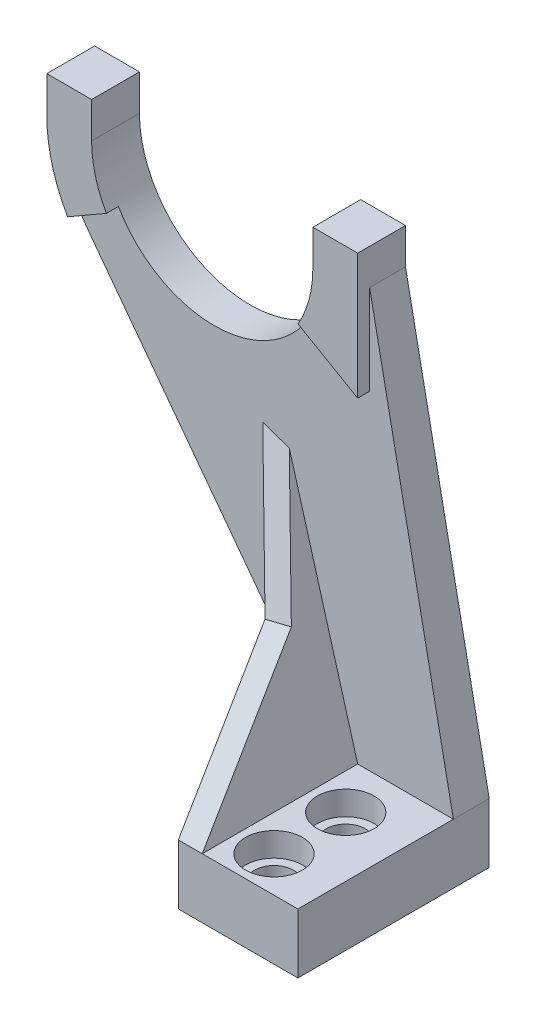
ISO-10303-21;
HEADER;
FILE_DESCRIPTION(('STEP AP214'),'2;1');
FILE_NAME('part.step','',(''),(''),'','','');
FILE_SCHEMA(('AUTOMOTIVE_DESIGN { 1 0 10303 214 1 1 1 1 }'));
ENDSEC;
DATA;
#1=APPLICATION_CONTEXT('core data for automotive mechanical design processes');
#2=APPLICATION_PROTOCOL_DEFINITION('international standard','automotive_design',2000,#1);
#3=PRODUCT_CONTEXT('',#1,'mechanical');
#4=PRODUCT('Part','Part','',(#3));
#5=PRODUCT_RELATED_PRODUCT_CATEGORY('part','',(#4));
#6=PRODUCT_DEFINITION_FORMATION('','',#4);
#7=PRODUCT_DEFINITION_CONTEXT('part definition',#1,'design');
#8=PRODUCT_DEFINITION('design','',#6,#7);
#9=PRODUCT_DEFINITION_SHAPE('','',#8);
#10=(LENGTH_UNIT() NAMED_UNIT(*) SI_UNIT(.MILLI.,.METRE.));
#11=(NAMED_UNIT(*) PLANE_ANGLE_UNIT() SI_UNIT($,.RADIAN.));
#12=(NAMED_UNIT(*) SI_UNIT($,.STERADIAN.) SOLID_ANGLE_UNIT());
#13=UNCERTAINTY_MEASURE_WITH_UNIT(LENGTH_MEASURE(1.E-05),#10,'distance_accuracy_value','');
#14=(GEOMETRIC_REPRESENTATION_CONTEXT(3) GLOBAL_UNCERTAINTY_ASSIGNED_CONTEXT((#13)) GLOBAL_UNIT_ASSIGNED_CONTEXT((#10,
#11,#12)) REPRESENTATION_CONTEXT('',''));
#15=CARTESIAN_POINT('',(0.,0.,0.));
#16=DIRECTION('',(0.,0.,1.));
#17=DIRECTION('',(1.,0.,0.));
#18=AXIS2_PLACEMENT_3D('',#15,#16,#17);
#19=CARTESIAN_POINT('',(0.,0.,9.525));
#20=DIRECTION('',(0.,0.,1.));
#21=DIRECTION('',(1.,0.,0.));
#22=AXIS2_PLACEMENT_3D('',#19,#20,#21);
#23=PLANE('',#22);
#24=DIRECTION('',(-0.946168264610413,0.323675169026169,0.));
#25=VECTOR('',#24,1.);
#26=CARTESIAN_POINT('',(23.0927149610242,67.5046964694676,9.525));
#27=LINE('',#26,#25);
#28=CARTESIAN_POINT('',(-11.8130347518233,79.4456216313817,9.52499999999999));
#29=VERTEX_POINT('',#28);
#30=CARTESIAN_POINT('',(-18.8509185029608,81.8532147603627,9.525));
#31=VERTEX_POINT('',#30);
#32=EDGE_CURVE('E213',#29,#31,#27,.T.);
#33=ORIENTED_EDGE('',*,*,#32,.F.);
#34=DIRECTION('',(-0.274721127897378,0.961523947640823,0.));
#35=VECTOR('',#34,1.);
#36=CARTESIAN_POINT('',(-12.5009185029608,81.8532147603627,9.525));
#37=LINE('',#36,#35);
#38=CARTESIAN_POINT('',(6.35,15.875,9.52499999999999));
#39=VERTEX_POINT('',#38);
#40=EDGE_CURVE('E198',#39,#29,#37,.T.);
#41=ORIENTED_EDGE('',*,*,#40,.F.);
#42=DIRECTION('',(-1.,0.,0.));
#43=VECTOR('',#42,1.);
#44=CARTESIAN_POINT('',(0.,15.875,9.525));
#45=LINE('',#44,#43);
#46=CARTESIAN_POINT('',(31.75,15.875,9.525));
#47=VERTEX_POINT('',#46);
#48=EDGE_CURVE('E228',#47,#39,#45,.T.);
#49=ORIENTED_EDGE('',*,*,#48,.F.);
#50=DIRECTION('',(-0.196116135138184,0.98058067569092,0.));
#51=VECTOR('',#50,1.);
#52=CARTESIAN_POINT('',(31.75,15.875,9.525));
#53=LINE('',#52,#51);
#54=CARTESIAN_POINT('',(9.52499999999998,127.,9.525));
#55=VERTEX_POINT('',#54);
#56=EDGE_CURVE('E297',#47,#55,#53,.T.);
#57=ORIENTED_EDGE('',*,*,#56,.T.);
#58=DIRECTION('',(0.,1.,0.));
#59=VECTOR('',#58,1.);
#60=CARTESIAN_POINT('',(9.52499999999998,0.,9.525));
#61=LINE('',#60,#59);
#62=CARTESIAN_POINT('',(9.52499999999999,103.169867639198,9.525));
#63=VERTEX_POINT('',#62);
#64=EDGE_CURVE('E267',#63,#55,#61,.T.);
#65=ORIENTED_EDGE('',*,*,#64,.F.);
#66=DIRECTION('',(-0.866025403784438,0.500000000000001,0.));
#67=VECTOR('',#66,1.);
#68=CARTESIAN_POINT('',(47.0551131403119,81.5018467149219,9.525));
#69=LINE('',#68,#67);
#70=CARTESIAN_POINT('',(-6.31591642260579,112.315625,9.525));
#71=VERTEX_POINT('',#70);
#72=EDGE_CURVE('E269',#63,#71,#69,.T.);
#73=ORIENTED_EDGE('',*,*,#72,.T.);
#74=CARTESIAN_POINT('',(-31.75,127.,9.525));
#75=DIRECTION('',(0.,0.,1.));
#76=DIRECTION('',(1.,0.,0.));
#77=AXIS2_PLACEMENT_3D('',#74,#75,#76);
#78=CIRCLE('',#77,29.36875);
#79=CARTESIAN_POINT('',(-57.1840835773943,112.315625,9.525));
#80=VERTEX_POINT('',#79);
#81=EDGE_CURVE('E305',#80,#71,#78,.T.);
#82=ORIENTED_EDGE('',*,*,#81,.F.);
#83=DIRECTION('',(0.866025403784442,0.499999999999995,0.));
#84=VECTOR('',#83,1.);
#85=CARTESIAN_POINT('',(-62.9301131403113,108.998153285079,9.525));
#86=LINE('',#85,#84);
#87=CARTESIAN_POINT('',(-67.4951985412029,106.3625,9.525));
#88=VERTEX_POINT('',#87);
#89=EDGE_CURVE('E69',#88,#80,#86,.T.);
#90=ORIENTED_EDGE('',*,*,#89,.F.);
#91=CARTESIAN_POINT('',(-31.75,127.,9.525));
#92=DIRECTION('',(0.,0.,1.));
#93=DIRECTION('',(1.,0.,0.));
#94=AXIS2_PLACEMENT_3D('',#91,#92,#93);
#95=CIRCLE('',#94,41.275);
#96=CARTESIAN_POINT('',(-64.77,102.235,9.525));
#97=VERTEX_POINT('',#96);
#98=EDGE_CURVE('E308',#88,#97,#95,.T.);
#99=ORIENTED_EDGE('',*,*,#98,.T.);
#100=DIRECTION('',(-0.6,0.8,0.));
#101=VECTOR('',#100,1.);
#102=CARTESIAN_POINT('',(7.62,5.715,9.525));
#103=LINE('',#102,#101);
#104=CARTESIAN_POINT('',(0.,15.875,9.52499999999999));
#105=VERTEX_POINT('',#104);
#106=EDGE_CURVE('E311',#105,#97,#103,.T.);
#107=ORIENTED_EDGE('',*,*,#106,.F.);
#108=DIRECTION('',(-0.274721127897378,0.961523947640823,0.));
#109=VECTOR('',#108,1.);
#110=CARTESIAN_POINT('',(-18.8509185029608,81.8532147603627,9.525));
#111=LINE('',#110,#109);
#112=EDGE_CURVE('E215',#105,#31,#111,.T.);
#113=ORIENTED_EDGE('',*,*,#112,.T.);
#114=EDGE_LOOP('',(#33,#41,#49,#57,#65,#73,#82,#90,#99,#107,#113));
#115=FACE_BOUND('',#114,.T.);
#116=ADVANCED_FACE('F41',(#115),#23,.T.);
#117=CARTESIAN_POINT('',(0.,15.875,50.8));
#118=DIRECTION('',(0.,-1.,0.));
#119=DIRECTION('',(0.,0.,-1.));
#120=AXIS2_PLACEMENT_3D('',#117,#118,#119);
#121=PLANE('',#120);
#122=CARTESIAN_POINT('',(15.875,15.875,22.225));
#123=DIRECTION('',(0.,1.,0.));
#124=DIRECTION('',(0.,0.,1.));
#125=AXIS2_PLACEMENT_3D('',#122,#123,#124);
#126=CIRCLE('',#125,7.540625);
#127=CARTESIAN_POINT('',(15.875,15.875,29.765625));
#128=VERTEX_POINT('',#127);
#129=EDGE_CURVE('E645',#128,#128,#126,.T.);
#130=ORIENTED_EDGE('',*,*,#129,.F.);
#131=EDGE_LOOP('',(#130));
#132=FACE_BOUND('',#131,.T.);
#133=CARTESIAN_POINT('',(15.875,15.875,41.275));
#134=DIRECTION('',(0.,1.,0.));
#135=DIRECTION('',(0.,0.,1.));
#136=AXIS2_PLACEMENT_3D('',#133,#134,#135);
#137=CIRCLE('',#136,7.540625);
#138=CARTESIAN_POINT('',(15.875,15.875,48.815625));
#139=VERTEX_POINT('',#138);
#140=EDGE_CURVE('E439',#139,#139,#137,.T.);
#141=ORIENTED_EDGE('',*,*,#140,.F.);
#142=EDGE_LOOP('',(#141));
#143=FACE_BOUND('',#142,.T.);
#144=DIRECTION('',(0.,0.,-1.));
#145=VECTOR('',#144,1.);
#146=CARTESIAN_POINT('',(6.35,15.875,9.52499999999999));
#147=LINE('',#146,#145);
#148=CARTESIAN_POINT('',(6.35,15.875,50.8));
#149=VERTEX_POINT('',#148);
#150=EDGE_CURVE('E226',#149,#39,#147,.T.);
#151=ORIENTED_EDGE('',*,*,#150,.F.);
#152=DIRECTION('',(-1.,0.,0.));
#153=VECTOR('',#152,1.);
#154=CARTESIAN_POINT('',(0.,15.875,50.8));
#155=LINE('',#154,#153);
#156=CARTESIAN_POINT('',(31.75,15.875,50.8));
#157=VERTEX_POINT('',#156);
#158=EDGE_CURVE('E237',#157,#149,#155,.T.);
#159=ORIENTED_EDGE('',*,*,#158,.F.);
#160=DIRECTION('',(0.,0.,-1.));
#161=VECTOR('',#160,1.);
#162=CARTESIAN_POINT('',(31.75,15.875,50.8));
#163=LINE('',#162,#161);
#164=EDGE_CURVE('E245',#157,#47,#163,.T.);
#165=ORIENTED_EDGE('',*,*,#164,.T.);
#166=ORIENTED_EDGE('',*,*,#48,.T.);
#167=EDGE_LOOP('',(#151,#159,#165,#166));
#168=FACE_BOUND('',#167,.T.);
#169=ADVANCED_FACE('F421',(#132,#143,#168),#121,.F.);
#170=CARTESIAN_POINT('',(-31.75,127.,9.525));
#171=DIRECTION('',(0.,0.,-1.));
#172=DIRECTION('',(-1.,0.,0.));
#173=AXIS2_PLACEMENT_3D('',#170,#171,#172);
#174=CYLINDRICAL_SURFACE('',#173,29.36875);
#175=DIRECTION('',(0.,0.,-1.));
#176=VECTOR('',#175,1.);
#177=CARTESIAN_POINT('',(-2.38125000000002,127.,9.525));
#178=LINE('',#177,#176);
#179=CARTESIAN_POINT('',(-2.38125000000002,127.,12.7));
#180=VERTEX_POINT('',#179);
#181=CARTESIAN_POINT('',(-2.38125000000002,127.,0.));
#182=VERTEX_POINT('',#181);
#183=EDGE_CURVE('E313',#180,#182,#178,.T.);
#184=ORIENTED_EDGE('',*,*,#183,.T.);
#185=CARTESIAN_POINT('',(-31.75,127.,0.));
#186=DIRECTION('',(0.,0.,1.));
#187=DIRECTION('',(1.,0.,0.));
#188=AXIS2_PLACEMENT_3D('',#185,#186,#187);
#189=CIRCLE('',#188,29.36875);
#190=CARTESIAN_POINT('',(-61.11875,127.,0.));
#191=VERTEX_POINT('',#190);
#192=EDGE_CURVE('E304',#191,#182,#189,.T.);
#193=ORIENTED_EDGE('',*,*,#192,.F.);
#194=DIRECTION('',(0.,0.,-1.));
#195=VECTOR('',#194,1.);
#196=CARTESIAN_POINT('',(-61.11875,127.,9.525));
#197=LINE('',#196,#195);
#198=CARTESIAN_POINT('',(-61.11875,127.,12.7));
#199=VERTEX_POINT('',#198);
#200=EDGE_CURVE('E52',#199,#191,#197,.T.);
#201=ORIENTED_EDGE('',*,*,#200,.F.);
#202=CARTESIAN_POINT('',(-31.75,127.,12.7));
#203=DIRECTION('',(0.,0.,1.));
#204=DIRECTION('',(1.,0.,0.));
#205=AXIS2_PLACEMENT_3D('',#202,#203,#204);
#206=CIRCLE('',#205,29.36875);
#207=CARTESIAN_POINT('',(-57.1840835773943,112.315625,12.7));
#208=VERTEX_POINT('',#207);
#209=EDGE_CURVE('E272',#199,#208,#206,.T.);
#210=ORIENTED_EDGE('',*,*,#209,.T.);
#211=DIRECTION('',(0.,0.,-1.));
#212=VECTOR('',#211,1.);
#213=CARTESIAN_POINT('',(-57.1840835773943,112.315625,12.7));
#214=LINE('',#213,#212);
#215=EDGE_CURVE('E289',#208,#80,#214,.T.);
#216=ORIENTED_EDGE('',*,*,#215,.T.);
#217=ORIENTED_EDGE('',*,*,#81,.T.);
#218=DIRECTION('',(0.,0.,-1.));
#219=VECTOR('',#218,1.);
#220=CARTESIAN_POINT('',(-6.31591642260579,112.315625,12.7));
#221=LINE('',#220,#219);
#222=CARTESIAN_POINT('',(-6.31591642260579,112.315625,12.7));
#223=VERTEX_POINT('',#222);
#224=EDGE_CURVE('E265',#223,#71,#221,.T.);
#225=ORIENTED_EDGE('',*,*,#224,.F.);
#226=CARTESIAN_POINT('',(-31.75,127.,12.7));
#227=DIRECTION('',(0.,0.,1.));
#228=DIRECTION('',(1.,0.,0.));
#229=AXIS2_PLACEMENT_3D('',#226,#227,#228);
#230=CIRCLE('',#229,29.36875);
#231=EDGE_CURVE('E248',#223,#180,#230,.T.);
#232=ORIENTED_EDGE('',*,*,#231,.T.);
#233=EDGE_LOOP('',(#184,#193,#201,#210,#216,#217,#225,#232));
#234=FACE_BOUND('',#233,.T.);
#235=ADVANCED_FACE('F43',(#234),#174,.F.);
#236=CARTESIAN_POINT('',(-61.1187499999999,0.,9.525));
#237=DIRECTION('',(1.,0.,0.));
#238=DIRECTION('',(0.,1.,0.));
#239=AXIS2_PLACEMENT_3D('',#236,#237,#238);
#240=PLANE('',#239);
#241=DIRECTION('',(0.,-1.,0.));
#242=VECTOR('',#241,1.);
#243=CARTESIAN_POINT('',(-61.1187499999999,0.,0.));
#244=LINE('',#243,#242);
#245=CARTESIAN_POINT('',(-61.11875,136.525,0.));
#246=VERTEX_POINT('',#245);
#247=EDGE_CURVE('E315',#246,#191,#244,.T.);
#248=ORIENTED_EDGE('',*,*,#247,.F.);
#249=DIRECTION('',(0.,0.,-1.));
#250=VECTOR('',#249,1.);
#251=CARTESIAN_POINT('',(-61.11875,136.525,9.525));
#252=LINE('',#251,#250);
#253=CARTESIAN_POINT('',(-61.11875,136.525,12.7));
#254=VERTEX_POINT('',#253);
#255=EDGE_CURVE('E368',#254,#246,#252,.T.);
#256=ORIENTED_EDGE('',*,*,#255,.F.);
#257=DIRECTION('',(0.,-1.,0.));
#258=VECTOR('',#257,1.);
#259=CARTESIAN_POINT('',(-61.1187499999999,0.,12.7));
#260=LINE('',#259,#258);
#261=EDGE_CURVE('E275',#254,#199,#260,.T.);
#262=ORIENTED_EDGE('',*,*,#261,.T.);
#263=ORIENTED_EDGE('',*,*,#200,.T.);
#264=EDGE_LOOP('',(#248,#256,#262,#263));
#265=FACE_BOUND('',#264,.T.);
#266=ADVANCED_FACE('F374',(#265),#240,.T.);
#267=CARTESIAN_POINT('',(0.,136.525,9.525));
#268=DIRECTION('',(0.,1.,0.));
#269=DIRECTION('',(0.,0.,1.));
#270=AXIS2_PLACEMENT_3D('',#267,#268,#269);
#271=PLANE('',#270);
#272=DIRECTION('',(1.,0.,0.));
#273=VECTOR('',#272,1.);
#274=CARTESIAN_POINT('',(0.,136.525,0.));
#275=LINE('',#274,#273);
#276=CARTESIAN_POINT('',(-73.025,136.525,0.));
#277=VERTEX_POINT('',#276);
#278=EDGE_CURVE('E318',#277,#246,#275,.T.);
#279=ORIENTED_EDGE('',*,*,#278,.F.);
#280=DIRECTION('',(0.,0.,-1.));
#281=VECTOR('',#280,1.);
#282=CARTESIAN_POINT('',(-73.025,136.525,9.525));
#283=LINE('',#282,#281);
#284=CARTESIAN_POINT('',(-73.025,136.525,12.7));
#285=VERTEX_POINT('',#284);
#286=EDGE_CURVE('E366',#285,#277,#283,.T.);
#287=ORIENTED_EDGE('',*,*,#286,.F.);
#288=DIRECTION('',(1.,0.,0.));
#289=VECTOR('',#288,1.);
#290=CARTESIAN_POINT('',(0.,136.525,12.7));
#291=LINE('',#290,#289);
#292=EDGE_CURVE('E278',#285,#254,#291,.T.);
#293=ORIENTED_EDGE('',*,*,#292,.T.);
#294=ORIENTED_EDGE('',*,*,#255,.T.);
#295=EDGE_LOOP('',(#279,#287,#293,#294));
#296=FACE_BOUND('',#295,.T.);
#297=ADVANCED_FACE('F385',(#296),#271,.T.);
#298=CARTESIAN_POINT('',(-73.025,0.,9.525));
#299=DIRECTION('',(-1.,0.,0.));
#300=DIRECTION('',(0.,0.,1.));
#301=AXIS2_PLACEMENT_3D('',#298,#299,#300);
#302=PLANE('',#301);
#303=DIRECTION('',(0.,1.,0.));
#304=VECTOR('',#303,1.);
#305=CARTESIAN_POINT('',(-73.025,0.,0.));
#306=LINE('',#305,#304);
#307=CARTESIAN_POINT('',(-73.025,127.,0.));
#308=VERTEX_POINT('',#307);
#309=EDGE_CURVE('E321',#308,#277,#306,.T.);
#310=ORIENTED_EDGE('',*,*,#309,.F.);
#311=DIRECTION('',(0.,0.,-1.));
#312=VECTOR('',#311,1.);
#313=CARTESIAN_POINT('',(-73.025,127.,9.525));
#314=LINE('',#313,#312);
#315=CARTESIAN_POINT('',(-73.025,127.,12.7));
#316=VERTEX_POINT('',#315);
#317=EDGE_CURVE('E364',#316,#308,#314,.T.);
#318=ORIENTED_EDGE('',*,*,#317,.F.);
#319=DIRECTION('',(0.,1.,0.));
#320=VECTOR('',#319,1.);
#321=CARTESIAN_POINT('',(-73.025,0.,12.7));
#322=LINE('',#321,#320);
#323=EDGE_CURVE('E281',#316,#285,#322,.T.);
#324=ORIENTED_EDGE('',*,*,#323,.T.);
#325=ORIENTED_EDGE('',*,*,#286,.T.);
#326=EDGE_LOOP('',(#310,#318,#324,#325));
#327=FACE_BOUND('',#326,.T.);
#328=ADVANCED_FACE('F518',(#327),#302,.T.);
#329=CARTESIAN_POINT('',(-31.75,127.,9.525));
#330=DIRECTION('',(0.,0.,-1.));
#331=DIRECTION('',(-1.,0.,0.));
#332=AXIS2_PLACEMENT_3D('',#329,#330,#331);
#333=CYLINDRICAL_SURFACE('',#332,41.275);
#334=ORIENTED_EDGE('',*,*,#98,.F.);
#335=DIRECTION('',(0.,0.,-1.));
#336=VECTOR('',#335,1.);
#337=CARTESIAN_POINT('',(-67.4951985412028,106.3625,12.7));
#338=LINE('',#337,#336);
#339=CARTESIAN_POINT('',(-67.4951985412028,106.3625,12.7));
#340=VERTEX_POINT('',#339);
#341=EDGE_CURVE('E292',#340,#88,#338,.T.);
#342=ORIENTED_EDGE('',*,*,#341,.F.);
#343=CARTESIAN_POINT('',(-31.75,127.,12.7));
#344=DIRECTION('',(0.,0.,1.));
#345=DIRECTION('',(1.,0.,0.));
#346=AXIS2_PLACEMENT_3D('',#343,#344,#345);
#347=CIRCLE('',#346,41.275);
#348=EDGE_CURVE('E284',#316,#340,#347,.T.);
#349=ORIENTED_EDGE('',*,*,#348,.F.);
#350=ORIENTED_EDGE('',*,*,#317,.T.);
#351=CARTESIAN_POINT('',(-31.75,127.,0.));
#352=DIRECTION('',(0.,0.,1.));
#353=DIRECTION('',(1.,0.,0.));
#354=AXIS2_PLACEMENT_3D('',#351,#352,#353);
#355=CIRCLE('',#354,41.275);
#356=CARTESIAN_POINT('',(-64.77,102.235,0.));
#357=VERTEX_POINT('',#356);
#358=EDGE_CURVE('E324',#308,#357,#355,.T.);
#359=ORIENTED_EDGE('',*,*,#358,.T.);
#360=DIRECTION('',(0.,0.,-1.));
#361=VECTOR('',#360,1.);
#362=CARTESIAN_POINT('',(-64.77,102.235,9.525));
#363=LINE('',#362,#361);
#364=EDGE_CURVE('E361',#97,#357,#363,.T.);
#365=ORIENTED_EDGE('',*,*,#364,.F.);
#366=EDGE_LOOP('',(#334,#342,#349,#350,#359,#365));
#367=FACE_BOUND('',#366,.T.);
#368=ADVANCED_FACE('F396',(#367),#333,.T.);
#369=CARTESIAN_POINT('',(7.62,5.715,9.525));
#370=DIRECTION('',(-0.8,-0.6,0.));
#371=DIRECTION('',(0.6,-0.8,0.));
#372=AXIS2_PLACEMENT_3D('',#369,#370,#371);
#373=PLANE('',#372);
#374=DIRECTION('',(-0.6,0.8,0.));
#375=VECTOR('',#374,1.);
#376=CARTESIAN_POINT('',(7.62,5.715,0.));
#377=LINE('',#376,#375);
#378=CARTESIAN_POINT('',(0.,15.875,0.));
#379=VERTEX_POINT('',#378);
#380=EDGE_CURVE('E326',#379,#357,#377,.T.);
#381=ORIENTED_EDGE('',*,*,#380,.F.);
#382=DIRECTION('',(0.,0.,-1.));
#383=VECTOR('',#382,1.);
#384=CARTESIAN_POINT('',(0.,15.875,9.525));
#385=LINE('',#384,#383);
#386=EDGE_CURVE('E359',#105,#379,#385,.T.);
#387=ORIENTED_EDGE('',*,*,#386,.F.);
#388=ORIENTED_EDGE('',*,*,#106,.T.);
#389=ORIENTED_EDGE('',*,*,#364,.T.);
#390=EDGE_LOOP('',(#381,#387,#388,#389));
#391=FACE_BOUND('',#390,.T.);
#392=ADVANCED_FACE('F409',(#391),#373,.T.);
#393=CARTESIAN_POINT('',(0.,0.,9.525));
#394=DIRECTION('',(-1.,0.,0.));
#395=DIRECTION('',(0.,0.,1.));
#396=AXIS2_PLACEMENT_3D('',#393,#394,#395);
#397=PLANE('',#396);
#398=DIRECTION('',(0.,1.,0.));
#399=VECTOR('',#398,1.);
#400=CARTESIAN_POINT('',(0.,0.,0.));
#401=LINE('',#400,#399);
#402=CARTESIAN_POINT('',(0.,0.,0.));
#403=VERTEX_POINT('',#402);
#404=EDGE_CURVE('E329',#403,#379,#401,.T.);
#405=ORIENTED_EDGE('',*,*,#404,.F.);
#406=DIRECTION('',(0.,0.,-1.));
#407=VECTOR('',#406,1.);
#408=CARTESIAN_POINT('',(0.,0.,9.525));
#409=LINE('',#408,#407);
#410=CARTESIAN_POINT('',(0.,0.,50.8));
#411=VERTEX_POINT('',#410);
#412=EDGE_CURVE('E357',#411,#403,#409,.T.);
#413=ORIENTED_EDGE('',*,*,#412,.F.);
#414=DIRECTION('',(0.,-1.,0.));
#415=VECTOR('',#414,1.);
#416=CARTESIAN_POINT('',(0.,0.,50.8));
#417=LINE('',#416,#415);
#418=CARTESIAN_POINT('',(0.,15.875,50.8));
#419=VERTEX_POINT('',#418);
#420=EDGE_CURVE('E229',#419,#411,#417,.T.);
#421=ORIENTED_EDGE('',*,*,#420,.F.);
#422=DIRECTION('',(0.,0.,-1.));
#423=VECTOR('',#422,1.);
#424=CARTESIAN_POINT('',(0.,15.875,50.8));
#425=LINE('',#424,#423);
#426=EDGE_CURVE('E240',#419,#105,#425,.T.);
#427=ORIENTED_EDGE('',*,*,#426,.T.);
#428=ORIENTED_EDGE('',*,*,#386,.T.);
#429=EDGE_LOOP('',(#405,#413,#421,#427,#428));
#430=FACE_BOUND('',#429,.T.);
#431=ADVANCED_FACE('F405',(#430),#397,.T.);
#432=CARTESIAN_POINT('',(0.,0.,9.525));
#433=DIRECTION('',(0.,1.,0.));
#434=DIRECTION('',(0.,0.,1.));
#435=AXIS2_PLACEMENT_3D('',#432,#433,#434);
#436=PLANE('',#435);
#437=CARTESIAN_POINT('',(15.875,0.,41.275));
#438=DIRECTION('',(0.,1.,0.));
#439=DIRECTION('',(0.,0.,1.));
#440=AXIS2_PLACEMENT_3D('',#437,#438,#439);
#441=CIRCLE('',#440,5.159375);
#442=CARTESIAN_POINT('',(15.875,0.,46.434375));
#443=VERTEX_POINT('',#442);
#444=EDGE_CURVE('E634',#443,#443,#441,.T.);
#445=ORIENTED_EDGE('',*,*,#444,.T.);
#446=EDGE_LOOP('',(#445));
#447=FACE_BOUND('',#446,.T.);
#448=CARTESIAN_POINT('',(15.875,0.,22.225));
#449=DIRECTION('',(0.,1.,0.));
#450=DIRECTION('',(0.,0.,1.));
#451=AXIS2_PLACEMENT_3D('',#448,#449,#450);
#452=CIRCLE('',#451,5.159375);
#453=CARTESIAN_POINT('',(15.875,0.,27.384375));
#454=VERTEX_POINT('',#453);
#455=EDGE_CURVE('E642',#454,#454,#452,.T.);
#456=ORIENTED_EDGE('',*,*,#455,.T.);
#457=EDGE_LOOP('',(#456));
#458=FACE_BOUND('',#457,.T.);
#459=DIRECTION('',(1.,0.,0.));
#460=VECTOR('',#459,1.);
#461=CARTESIAN_POINT('',(0.,0.,0.));
#462=LINE('',#461,#460);
#463=CARTESIAN_POINT('',(31.75,0.,0.));
#464=VERTEX_POINT('',#463);
#465=EDGE_CURVE('E332',#403,#464,#462,.T.);
#466=ORIENTED_EDGE('',*,*,#465,.T.);
#467=DIRECTION('',(0.,0.,-1.));
#468=VECTOR('',#467,1.);
#469=CARTESIAN_POINT('',(31.75,0.,9.525));
#470=LINE('',#469,#468);
#471=CARTESIAN_POINT('',(31.75,0.,50.8));
#472=VERTEX_POINT('',#471);
#473=EDGE_CURVE('E354',#472,#464,#470,.T.);
#474=ORIENTED_EDGE('',*,*,#473,.F.);
#475=DIRECTION('',(1.,0.,0.));
#476=VECTOR('',#475,1.);
#477=CARTESIAN_POINT('',(0.,0.,50.8));
#478=LINE('',#477,#476);
#479=EDGE_CURVE('E232',#411,#472,#478,.T.);
#480=ORIENTED_EDGE('',*,*,#479,.F.);
#481=ORIENTED_EDGE('',*,*,#412,.T.);
#482=EDGE_LOOP('',(#466,#474,#480,#481));
#483=FACE_BOUND('',#482,.T.);
#484=ADVANCED_FACE('F414',(#447,#458,#483),#436,.F.);
#485=CARTESIAN_POINT('',(31.75,0.,9.525));
#486=DIRECTION('',(-1.,0.,0.));
#487=DIRECTION('',(0.,0.,1.));
#488=AXIS2_PLACEMENT_3D('',#485,#486,#487);
#489=PLANE('',#488);
#490=DIRECTION('',(0.,1.,0.));
#491=VECTOR('',#490,1.);
#492=CARTESIAN_POINT('',(31.75,0.,0.));
#493=LINE('',#492,#491);
#494=CARTESIAN_POINT('',(31.75,15.875,0.));
#495=VERTEX_POINT('',#494);
#496=EDGE_CURVE('E334',#464,#495,#493,.T.);
#497=ORIENTED_EDGE('',*,*,#496,.T.);
#498=DIRECTION('',(0.,0.,-1.));
#499=VECTOR('',#498,1.);
#500=CARTESIAN_POINT('',(31.75,15.875,9.525));
#501=LINE('',#500,#499);
#502=EDGE_CURVE('E351',#47,#495,#501,.T.);
#503=ORIENTED_EDGE('',*,*,#502,.F.);
#504=ORIENTED_EDGE('',*,*,#164,.F.);
#505=DIRECTION('',(0.,1.,0.));
#506=VECTOR('',#505,1.);
#507=CARTESIAN_POINT('',(31.75,0.,50.8));
#508=LINE('',#507,#506);
#509=EDGE_CURVE('E235',#472,#157,#508,.T.);
#510=ORIENTED_EDGE('',*,*,#509,.F.);
#511=ORIENTED_EDGE('',*,*,#473,.T.);
#512=EDGE_LOOP('',(#497,#503,#504,#510,#511));
#513=FACE_BOUND('',#512,.T.);
#514=ADVANCED_FACE('F504',(#513),#489,.F.);
#515=CARTESIAN_POINT('',(9.52499999999998,0.,9.525));
#516=DIRECTION('',(1.,0.,0.));
#517=DIRECTION('',(0.,0.,-1.));
#518=AXIS2_PLACEMENT_3D('',#515,#516,#517);
#519=PLANE('',#518);
#520=DIRECTION('',(0.,0.,1.));
#521=VECTOR('',#520,1.);
#522=CARTESIAN_POINT('',(9.52499999999998,127.,9.525));
#523=LINE('',#522,#521);
#524=CARTESIAN_POINT('',(9.52499999999999,127.,0.));
#525=VERTEX_POINT('',#524);
#526=EDGE_CURVE('E300',#525,#55,#523,.T.);
#527=ORIENTED_EDGE('',*,*,#526,.F.);
#528=DIRECTION('',(0.,-1.,0.));
#529=VECTOR('',#528,1.);
#530=CARTESIAN_POINT('',(9.52499999999998,0.,0.));
#531=LINE('',#530,#529);
#532=CARTESIAN_POINT('',(9.52499999999998,136.525,0.));
#533=VERTEX_POINT('',#532);
#534=EDGE_CURVE('E337',#533,#525,#531,.T.);
#535=ORIENTED_EDGE('',*,*,#534,.F.);
#536=DIRECTION('',(0.,0.,-1.));
#537=VECTOR('',#536,1.);
#538=CARTESIAN_POINT('',(9.52499999999998,136.525,9.525));
#539=LINE('',#538,#537);
#540=CARTESIAN_POINT('',(9.52499999999998,136.525,12.7));
#541=VERTEX_POINT('',#540);
#542=EDGE_CURVE('E348',#541,#533,#539,.T.);
#543=ORIENTED_EDGE('',*,*,#542,.F.);
#544=DIRECTION('',(0.,-1.,0.));
#545=VECTOR('',#544,1.);
#546=CARTESIAN_POINT('',(9.52499999999998,0.,12.7));
#547=LINE('',#546,#545);
#548=CARTESIAN_POINT('',(9.52499999999999,103.169867639198,12.7));
#549=VERTEX_POINT('',#548);
#550=EDGE_CURVE('E253',#541,#549,#547,.T.);
#551=ORIENTED_EDGE('',*,*,#550,.T.);
#552=DIRECTION('',(0.,0.,-1.));
#553=VECTOR('',#552,1.);
#554=CARTESIAN_POINT('',(9.52499999999999,103.169867639198,12.7));
#555=LINE('',#554,#553);
#556=EDGE_CURVE('E262',#549,#63,#555,.T.);
#557=ORIENTED_EDGE('',*,*,#556,.T.);
#558=ORIENTED_EDGE('',*,*,#64,.T.);
#559=EDGE_LOOP('',(#527,#535,#543,#551,#557,#558));
#560=FACE_BOUND('',#559,.T.);
#561=ADVANCED_FACE('F500',(#560),#519,.T.);
#562=CARTESIAN_POINT('',(0.,136.525,9.525));
#563=DIRECTION('',(0.,1.,0.));
#564=DIRECTION('',(0.,0.,1.));
#565=AXIS2_PLACEMENT_3D('',#562,#563,#564);
#566=PLANE('',#565);
#567=ORIENTED_EDGE('',*,*,#542,.T.);
#568=DIRECTION('',(1.,0.,0.));
#569=VECTOR('',#568,1.);
#570=CARTESIAN_POINT('',(0.,136.525,0.));
#571=LINE('',#570,#569);
#572=CARTESIAN_POINT('',(-2.38125000000002,136.525,0.));
#573=VERTEX_POINT('',#572);
#574=EDGE_CURVE('E340',#573,#533,#571,.T.);
#575=ORIENTED_EDGE('',*,*,#574,.F.);
#576=DIRECTION('',(0.,0.,-1.));
#577=VECTOR('',#576,1.);
#578=CARTESIAN_POINT('',(-2.38125000000002,136.525,9.525));
#579=LINE('',#578,#577);
#580=CARTESIAN_POINT('',(-2.38125000000002,136.525,12.7));
#581=VERTEX_POINT('',#580);
#582=EDGE_CURVE('E346',#581,#573,#579,.T.);
#583=ORIENTED_EDGE('',*,*,#582,.F.);
#584=DIRECTION('',(1.,0.,0.));
#585=VECTOR('',#584,1.);
#586=CARTESIAN_POINT('',(0.,136.525,12.7));
#587=LINE('',#586,#585);
#588=EDGE_CURVE('E256',#581,#541,#587,.T.);
#589=ORIENTED_EDGE('',*,*,#588,.T.);
#590=EDGE_LOOP('',(#567,#575,#583,#589));
#591=FACE_BOUND('',#590,.T.);
#592=ADVANCED_FACE('F496',(#591),#566,.T.);
#593=CARTESIAN_POINT('',(-2.38125000000002,0.,9.525));
#594=DIRECTION('',(-1.,0.,0.));
#595=DIRECTION('',(0.,0.,1.));
#596=AXIS2_PLACEMENT_3D('',#593,#594,#595);
#597=PLANE('',#596);
#598=DIRECTION('',(0.,1.,0.));
#599=VECTOR('',#598,1.);
#600=CARTESIAN_POINT('',(-2.38125000000002,0.,0.));
#601=LINE('',#600,#599);
#602=EDGE_CURVE('E309',#182,#573,#601,.T.);
#603=ORIENTED_EDGE('',*,*,#602,.F.);
#604=ORIENTED_EDGE('',*,*,#183,.F.);
#605=DIRECTION('',(0.,1.,0.));
#606=VECTOR('',#605,1.);
#607=CARTESIAN_POINT('',(-2.38125000000002,0.,12.7));
#608=LINE('',#607,#606);
#609=EDGE_CURVE('E259',#180,#581,#608,.T.);
#610=ORIENTED_EDGE('',*,*,#609,.T.);
#611=ORIENTED_EDGE('',*,*,#582,.T.);
#612=EDGE_LOOP('',(#603,#604,#610,#611));
#613=FACE_BOUND('',#612,.T.);
#614=ADVANCED_FACE('F493',(#613),#597,.T.);
#615=CARTESIAN_POINT('',(0.,0.,0.));
#616=DIRECTION('',(0.,0.,1.));
#617=DIRECTION('',(1.,0.,0.));
#618=AXIS2_PLACEMENT_3D('',#615,#616,#617);
#619=PLANE('',#618);
#620=ORIENTED_EDGE('',*,*,#192,.T.);
#621=ORIENTED_EDGE('',*,*,#602,.T.);
#622=ORIENTED_EDGE('',*,*,#574,.T.);
#623=ORIENTED_EDGE('',*,*,#534,.T.);
#624=DIRECTION('',(-0.196116135138184,0.98058067569092,0.));
#625=VECTOR('',#624,1.);
#626=CARTESIAN_POINT('',(31.75,15.875,0.));
#627=LINE('',#626,#625);
#628=EDGE_CURVE('E296',#495,#525,#627,.T.);
#629=ORIENTED_EDGE('',*,*,#628,.F.);
#630=ORIENTED_EDGE('',*,*,#496,.F.);
#631=ORIENTED_EDGE('',*,*,#465,.F.);
#632=ORIENTED_EDGE('',*,*,#404,.T.);
#633=ORIENTED_EDGE('',*,*,#380,.T.);
#634=ORIENTED_EDGE('',*,*,#358,.F.);
#635=ORIENTED_EDGE('',*,*,#309,.T.);
#636=ORIENTED_EDGE('',*,*,#278,.T.);
#637=ORIENTED_EDGE('',*,*,#247,.T.);
#638=EDGE_LOOP('',(#620,#621,#622,#623,#629,#630,#631,#632,#633,#634,#635,#636,#637));
#639=FACE_BOUND('',#638,.T.);
#640=ADVANCED_FACE('F380',(#639),#619,.F.);
#641=CARTESIAN_POINT('',(31.75,15.875,4.7625));
#642=DIRECTION('',(0.98058067569092,0.196116135138184,0.));
#643=DIRECTION('',(-0.196116135138184,0.98058067569092,0.));
#644=AXIS2_PLACEMENT_3D('',#641,#642,#643);
#645=PLANE('',#644);
#646=ORIENTED_EDGE('',*,*,#56,.F.);
#647=ORIENTED_EDGE('',*,*,#502,.T.);
#648=ORIENTED_EDGE('',*,*,#628,.T.);
#649=ORIENTED_EDGE('',*,*,#526,.T.);
#650=EDGE_LOOP('',(#646,#647,#648,#649));
#651=FACE_BOUND('',#650,.T.);
#652=ADVANCED_FACE('F485',(#651),#645,.T.);
#653=CARTESIAN_POINT('',(-62.9301131403113,108.998153285079,12.7));
#654=DIRECTION('',(0.499999999999995,-0.866025403784442,0.));
#655=DIRECTION('',(0.866025403784442,0.499999999999995,0.));
#656=AXIS2_PLACEMENT_3D('',#653,#654,#655);
#657=PLANE('',#656);
#658=ORIENTED_EDGE('',*,*,#341,.T.);
#659=ORIENTED_EDGE('',*,*,#89,.T.);
#660=ORIENTED_EDGE('',*,*,#215,.F.);
#661=DIRECTION('',(-0.866025403784442,-0.499999999999995,0.));
#662=VECTOR('',#661,1.);
#663=CARTESIAN_POINT('',(-62.9301131403113,108.998153285079,12.7));
#664=LINE('',#663,#662);
#665=EDGE_CURVE('E286',#208,#340,#664,.T.);
#666=ORIENTED_EDGE('',*,*,#665,.T.);
#667=EDGE_LOOP('',(#658,#659,#660,#666));
#668=FACE_BOUND('',#667,.T.);
#669=ADVANCED_FACE('F392',(#668),#657,.T.);
#670=CARTESIAN_POINT('',(0.,0.,12.7));
#671=DIRECTION('',(0.,0.,1.));
#672=DIRECTION('',(1.,0.,0.));
#673=AXIS2_PLACEMENT_3D('',#670,#671,#672);
#674=PLANE('',#673);
#675=ORIENTED_EDGE('',*,*,#209,.F.);
#676=ORIENTED_EDGE('',*,*,#261,.F.);
#677=ORIENTED_EDGE('',*,*,#292,.F.);
#678=ORIENTED_EDGE('',*,*,#323,.F.);
#679=ORIENTED_EDGE('',*,*,#348,.T.);
#680=ORIENTED_EDGE('',*,*,#665,.F.);
#681=EDGE_LOOP('',(#675,#676,#677,#678,#679,#680));
#682=FACE_BOUND('',#681,.T.);
#683=ADVANCED_FACE('F388',(#682),#674,.T.);
#684=CARTESIAN_POINT('',(47.0551131403119,81.5018467149219,12.7));
#685=DIRECTION('',(0.500000000000001,0.866025403784438,0.));
#686=DIRECTION('',(-0.866025403784438,0.500000000000001,0.));
#687=AXIS2_PLACEMENT_3D('',#684,#685,#686);
#688=PLANE('',#687);
#689=ORIENTED_EDGE('',*,*,#72,.F.);
#690=ORIENTED_EDGE('',*,*,#556,.F.);
#691=DIRECTION('',(0.866025403784438,-0.500000000000001,0.));
#692=VECTOR('',#691,1.);
#693=CARTESIAN_POINT('',(47.0551131403119,81.5018467149219,12.7));
#694=LINE('',#693,#692);
#695=EDGE_CURVE('E251',#223,#549,#694,.T.);
#696=ORIENTED_EDGE('',*,*,#695,.F.);
#697=ORIENTED_EDGE('',*,*,#224,.T.);
#698=EDGE_LOOP('',(#689,#690,#696,#697));
#699=FACE_BOUND('',#698,.T.);
#700=ADVANCED_FACE('F476',(#699),#688,.F.);
#701=CARTESIAN_POINT('',(0.,0.,12.7));
#702=DIRECTION('',(0.,0.,1.));
#703=DIRECTION('',(1.,0.,0.));
#704=AXIS2_PLACEMENT_3D('',#701,#702,#703);
#705=PLANE('',#704);
#706=ORIENTED_EDGE('',*,*,#231,.F.);
#707=ORIENTED_EDGE('',*,*,#695,.T.);
#708=ORIENTED_EDGE('',*,*,#550,.F.);
#709=ORIENTED_EDGE('',*,*,#588,.F.);
#710=ORIENTED_EDGE('',*,*,#609,.F.);
#711=EDGE_LOOP('',(#706,#707,#708,#709,#710));
#712=FACE_BOUND('',#711,.T.);
#713=ADVANCED_FACE('F470',(#712),#705,.T.);
#714=CARTESIAN_POINT('',(0.,0.,50.8));
#715=DIRECTION('',(0.,0.,-1.));
#716=DIRECTION('',(-1.,0.,0.));
#717=AXIS2_PLACEMENT_3D('',#714,#715,#716);
#718=PLANE('',#717);
#719=ORIENTED_EDGE('',*,*,#158,.T.);
#720=DIRECTION('',(1.,0.,0.));
#721=VECTOR('',#720,1.);
#722=CARTESIAN_POINT('',(-73.025,15.875,50.8));
#723=LINE('',#722,#721);
#724=EDGE_CURVE('E212',#419,#149,#723,.T.);
#725=ORIENTED_EDGE('',*,*,#724,.F.);
#726=ORIENTED_EDGE('',*,*,#420,.T.);
#727=ORIENTED_EDGE('',*,*,#479,.T.);
#728=ORIENTED_EDGE('',*,*,#509,.T.);
#729=EDGE_LOOP('',(#719,#725,#726,#727,#728));
#730=FACE_BOUND('',#729,.T.);
#731=ADVANCED_FACE('F417',(#730),#718,.F.);
#732=CARTESIAN_POINT('',(10.5433962264151,1.19811320754717,0.));
#733=DIRECTION('',(-0.961523947640823,-0.274721127897378,0.));
#734=DIRECTION('',(0.274721127897378,-0.961523947640823,0.));
#735=AXIS2_PLACEMENT_3D('',#732,#733,#734);
#736=PLANE('',#735);
#737=ORIENTED_EDGE('',*,*,#40,.T.);
#738=DIRECTION('',(0.265987761533281,-0.930957165366482,0.250138495572589));
#739=VECTOR('',#738,1.);
#740=CARTESIAN_POINT('',(-2.61201845225119,47.2420645828792,18.1777604189258));
#741=LINE('',#740,#739);
#742=CARTESIAN_POINT('',(-2.61201845225119,47.2420645828792,18.1777604189258));
#743=VERTEX_POINT('',#742);
#744=EDGE_CURVE('E191',#29,#743,#741,.T.);
#745=ORIENTED_EDGE('',*,*,#744,.T.);
#746=DIRECTION('',(-0.194257172471453,0.679900103650085,-0.707106781186548));
#747=VECTOR('',#746,1.);
#748=CARTESIAN_POINT('',(1.22915882310471,33.7979441191335,32.1598567533248));
#749=LINE('',#748,#747);
#750=EDGE_CURVE('E195',#149,#743,#749,.T.);
#751=ORIENTED_EDGE('',*,*,#750,.F.);
#752=ORIENTED_EDGE('',*,*,#150,.T.);
#753=EDGE_LOOP('',(#737,#745,#751,#752));
#754=FACE_BOUND('',#753,.T.);
#755=ADVANCED_FACE('F193',(#754),#736,.F.);
#756=CARTESIAN_POINT('',(4.19339622641509,1.19811320754717,0.));
#757=DIRECTION('',(-0.961523947640823,-0.274721127897378,0.));
#758=DIRECTION('',(0.274721127897378,-0.961523947640823,0.));
#759=AXIS2_PLACEMENT_3D('',#756,#757,#758);
#760=PLANE('',#759);
#761=DIRECTION('',(0.194257172471453,-0.679900103650085,0.707106781186548));
#762=VECTOR('',#761,1.);
#763=CARTESIAN_POINT('',(-4.88121853538585,32.9592648738505,33.032096334399));
#764=LINE('',#763,#762);
#765=CARTESIAN_POINT('',(-8.72239581074176,46.4033853375961,19.05));
#766=VERTEX_POINT('',#765);
#767=EDGE_CURVE('E12',#766,#419,#764,.T.);
#768=ORIENTED_EDGE('',*,*,#767,.F.);
#769=DIRECTION('',(0.265987761533281,-0.930957165366482,0.250138495572589));
#770=VECTOR('',#769,1.);
#771=CARTESIAN_POINT('',(-8.72239581074176,46.4033853375961,19.05));
#772=LINE('',#771,#770);
#773=EDGE_CURVE('E60',#31,#766,#772,.T.);
#774=ORIENTED_EDGE('',*,*,#773,.F.);
#775=ORIENTED_EDGE('',*,*,#112,.F.);
#776=ORIENTED_EDGE('',*,*,#426,.F.);
#777=EDGE_LOOP('',(#768,#774,#775,#776));
#778=FACE_BOUND('',#777,.T.);
#779=ADVANCED_FACE('F408',(#778),#760,.T.);
#780=CARTESIAN_POINT('',(-78.1458411768953,33.7979441191335,32.1598567533248));
#781=DIRECTION('',(0.,-0.720838291947129,-0.693103280083672));
#782=DIRECTION('',(0.,0.693103280083672,-0.72083829194713));
#783=AXIS2_PLACEMENT_3D('',#780,#781,#782);
#784=PLANE('',#783);
#785=ORIENTED_EDGE('',*,*,#750,.T.);
#786=DIRECTION('',(-0.980950636343846,-0.134640283419743,0.140028008402801));
#787=VECTOR('',#786,1.);
#788=CARTESIAN_POINT('',(-2.61201845225119,47.2420645828792,18.1777604189258));
#789=LINE('',#788,#787);
#790=EDGE_CURVE('E201',#743,#766,#789,.T.);
#791=ORIENTED_EDGE('',*,*,#790,.T.);
#792=ORIENTED_EDGE('',*,*,#767,.T.);
#793=ORIENTED_EDGE('',*,*,#724,.T.);
#794=EDGE_LOOP('',(#785,#791,#792,#793));
#795=FACE_BOUND('',#794,.T.);
#796=ADVANCED_FACE('F210',(#795),#784,.F.);
#797=CARTESIAN_POINT('',(2.96428073259444,8.66519469199754,29.0977311370273));
#798=DIRECTION('',(0.0971738375123417,0.284058865192569,0.953869910631756));
#799=DIRECTION('',(0.,-0.958405638139827,0.285409587753796));
#800=AXIS2_PLACEMENT_3D('',#797,#798,#799);
#801=PLANE('',#800);
#802=ORIENTED_EDGE('',*,*,#744,.F.);
#803=ORIENTED_EDGE('',*,*,#32,.T.);
#804=ORIENTED_EDGE('',*,*,#773,.T.);
#805=ORIENTED_EDGE('',*,*,#790,.F.);
#806=EDGE_LOOP('',(#802,#803,#804,#805));
#807=FACE_BOUND('',#806,.T.);
#808=ADVANCED_FACE('F206',(#807),#801,.T.);
#809=CARTESIAN_POINT('',(15.875,9.525,41.275));
#810=DIRECTION('',(0.,1.,0.));
#811=DIRECTION('',(0.,0.,1.));
#812=AXIS2_PLACEMENT_3D('',#809,#810,#811);
#813=CYLINDRICAL_SURFACE('',#812,7.540625);
#814=CARTESIAN_POINT('',(15.875,9.525,41.275));
#815=DIRECTION('',(0.,1.,0.));
#816=DIRECTION('',(0.,0.,1.));
#817=AXIS2_PLACEMENT_3D('',#814,#815,#816);
#818=CIRCLE('',#817,7.540625);
#819=CARTESIAN_POINT('',(15.875,9.525,48.815625));
#820=VERTEX_POINT('',#819);
#821=EDGE_CURVE('E202',#820,#820,#818,.T.);
#822=ORIENTED_EDGE('',*,*,#821,.F.);
#823=EDGE_LOOP('',(#822));
#824=FACE_BOUND('',#823,.T.);
#825=ORIENTED_EDGE('',*,*,#140,.T.);
#826=EDGE_LOOP('',(#825));
#827=FACE_BOUND('',#826,.T.);
#828=ADVANCED_FACE('F451',(#824,#827),#813,.F.);
#829=CARTESIAN_POINT('',(15.875,9.525,41.275));
#830=DIRECTION('',(0.,1.,0.));
#831=DIRECTION('',(0.,0.,1.));
#832=AXIS2_PLACEMENT_3D('',#829,#830,#831);
#833=PLANE('',#832);
#834=CARTESIAN_POINT('',(15.875,9.525,41.275));
#835=DIRECTION('',(0.,1.,0.));
#836=DIRECTION('',(0.,0.,1.));
#837=AXIS2_PLACEMENT_3D('',#834,#835,#836);
#838=CIRCLE('',#837,5.159375);
#839=CARTESIAN_POINT('',(15.875,9.525,46.434375));
#840=VERTEX_POINT('',#839);
#841=EDGE_CURVE('E637',#840,#840,#838,.T.);
#842=ORIENTED_EDGE('',*,*,#841,.F.);
#843=EDGE_LOOP('',(#842));
#844=FACE_BOUND('',#843,.T.);
#845=ORIENTED_EDGE('',*,*,#821,.T.);
#846=EDGE_LOOP('',(#845));
#847=FACE_BOUND('',#846,.T.);
#848=ADVANCED_FACE('F578',(#844,#847),#833,.T.);
#849=CARTESIAN_POINT('',(15.875,9.525,22.225));
#850=DIRECTION('',(0.,1.,0.));
#851=DIRECTION('',(0.,0.,1.));
#852=AXIS2_PLACEMENT_3D('',#849,#850,#851);
#853=CYLINDRICAL_SURFACE('',#852,7.540625);
#854=CARTESIAN_POINT('',(15.875,9.525,22.225));
#855=DIRECTION('',(0.,1.,0.));
#856=DIRECTION('',(0.,0.,1.));
#857=AXIS2_PLACEMENT_3D('',#854,#855,#856);
#858=CIRCLE('',#857,7.540625);
#859=CARTESIAN_POINT('',(15.875,9.525,29.765625));
#860=VERTEX_POINT('',#859);
#861=EDGE_CURVE('E648',#860,#860,#858,.T.);
#862=ORIENTED_EDGE('',*,*,#861,.F.);
#863=EDGE_LOOP('',(#862));
#864=FACE_BOUND('',#863,.T.);
#865=ORIENTED_EDGE('',*,*,#129,.T.);
#866=EDGE_LOOP('',(#865));
#867=FACE_BOUND('',#866,.T.);
#868=ADVANCED_FACE('F585',(#864,#867),#853,.F.);
#869=CARTESIAN_POINT('',(15.875,9.525,22.225));
#870=DIRECTION('',(0.,1.,0.));
#871=DIRECTION('',(0.,0.,1.));
#872=AXIS2_PLACEMENT_3D('',#869,#870,#871);
#873=PLANE('',#872);
#874=CARTESIAN_POINT('',(15.875,9.525,22.225));
#875=DIRECTION('',(0.,1.,0.));
#876=DIRECTION('',(0.,0.,1.));
#877=AXIS2_PLACEMENT_3D('',#874,#875,#876);
#878=CIRCLE('',#877,5.159375);
#879=CARTESIAN_POINT('',(15.875,9.525,27.384375));
#880=VERTEX_POINT('',#879);
#881=EDGE_CURVE('E639',#880,#880,#878,.T.);
#882=ORIENTED_EDGE('',*,*,#881,.F.);
#883=EDGE_LOOP('',(#882));
#884=FACE_BOUND('',#883,.T.);
#885=ORIENTED_EDGE('',*,*,#861,.T.);
#886=EDGE_LOOP('',(#885));
#887=FACE_BOUND('',#886,.T.);
#888=ADVANCED_FACE('F593',(#884,#887),#873,.T.);
#889=CARTESIAN_POINT('',(15.875,0.,22.225));
#890=DIRECTION('',(0.,1.,0.));
#891=DIRECTION('',(0.,0.,1.));
#892=AXIS2_PLACEMENT_3D('',#889,#890,#891);
#893=CYLINDRICAL_SURFACE('',#892,5.159375);
#894=CARTESIAN_POINT('',(15.875,0.,27.384375));
#895=CARTESIAN_POINT('',(15.875,0.0992187499999999,27.384375));
#896=CARTESIAN_POINT('',(15.875,0.1984375,27.384375));
#897=CARTESIAN_POINT('',(15.875,0.396875,27.384375));
#898=CARTESIAN_POINT('',(15.875,0.49609375,27.384375));
#899=CARTESIAN_POINT('',(15.875,0.69453125,27.384375));
#900=CARTESIAN_POINT('',(15.875,0.79375,27.384375));
#901=CARTESIAN_POINT('',(15.875,0.9921875,27.384375));
#902=CARTESIAN_POINT('',(15.875,1.09140625,27.384375));
#903=CARTESIAN_POINT('',(15.875,1.28984375,27.384375));
#904=CARTESIAN_POINT('',(15.875,1.3890625,27.384375));
#905=CARTESIAN_POINT('',(15.875,1.5875,27.384375));
#906=CARTESIAN_POINT('',(15.875,1.68671875,27.384375));
#907=CARTESIAN_POINT('',(15.875,1.88515625,27.384375));
#908=CARTESIAN_POINT('',(15.875,1.984375,27.384375));
#909=CARTESIAN_POINT('',(15.875,2.1828125,27.384375));
#910=CARTESIAN_POINT('',(15.875,2.28203125,27.384375));
#911=CARTESIAN_POINT('',(15.875,2.48046875,27.384375));
#912=CARTESIAN_POINT('',(15.875,2.5796875,27.384375));
#913=CARTESIAN_POINT('',(15.875,2.778125,27.384375));
#914=CARTESIAN_POINT('',(15.875,2.87734375,27.384375));
#915=CARTESIAN_POINT('',(15.875,3.07578125,27.384375));
#916=CARTESIAN_POINT('',(15.875,3.175,27.384375));
#917=CARTESIAN_POINT('',(15.875,3.3734375,27.384375));
#918=CARTESIAN_POINT('',(15.875,3.47265625,27.384375));
#919=CARTESIAN_POINT('',(15.875,3.67109375,27.384375));
#920=CARTESIAN_POINT('',(15.875,3.7703125,27.384375));
#921=CARTESIAN_POINT('',(15.875,3.96875,27.384375));
#922=CARTESIAN_POINT('',(15.875,4.06796875,27.384375));
#923=CARTESIAN_POINT('',(15.875,4.26640625,27.384375));
#924=CARTESIAN_POINT('',(15.875,4.365625,27.384375));
#925=CARTESIAN_POINT('',(15.875,4.5640625,27.384375));
#926=CARTESIAN_POINT('',(15.875,4.66328125,27.384375));
#927=CARTESIAN_POINT('',(15.875,4.86171875,27.384375));
#928=CARTESIAN_POINT('',(15.875,4.9609375,27.384375));
#929=CARTESIAN_POINT('',(15.875,5.159375,27.384375));
#930=CARTESIAN_POINT('',(15.875,5.25859375,27.384375));
#931=CARTESIAN_POINT('',(15.875,5.45703125,27.384375));
#932=CARTESIAN_POINT('',(15.875,5.55625,27.384375));
#933=CARTESIAN_POINT('',(15.875,5.7546875,27.384375));
#934=CARTESIAN_POINT('',(15.875,5.85390625,27.384375));
#935=CARTESIAN_POINT('',(15.875,6.05234375,27.384375));
#936=CARTESIAN_POINT('',(15.875,6.1515625,27.384375));
#937=CARTESIAN_POINT('',(15.875,6.35,27.384375));
#938=CARTESIAN_POINT('',(15.875,6.44921875,27.384375));
#939=CARTESIAN_POINT('',(15.875,6.64765625,27.384375));
#940=CARTESIAN_POINT('',(15.875,6.746875,27.384375));
#941=CARTESIAN_POINT('',(15.875,6.9453125,27.384375));
#942=CARTESIAN_POINT('',(15.875,7.04453125,27.384375));
#943=CARTESIAN_POINT('',(15.875,7.24296875,27.384375));
#944=CARTESIAN_POINT('',(15.875,7.3421875,27.384375));
#945=CARTESIAN_POINT('',(15.875,7.540625,27.384375));
#946=CARTESIAN_POINT('',(15.875,7.63984375,27.384375));
#947=CARTESIAN_POINT('',(15.875,7.83828125,27.384375));
#948=CARTESIAN_POINT('',(15.875,7.9375,27.384375));
#949=CARTESIAN_POINT('',(15.875,8.1359375,27.384375));
#950=CARTESIAN_POINT('',(15.875,8.23515625,27.384375));
#951=CARTESIAN_POINT('',(15.875,8.43359375,27.384375));
#952=CARTESIAN_POINT('',(15.875,8.5328125,27.384375));
#953=CARTESIAN_POINT('',(15.875,8.73125,27.384375));
#954=CARTESIAN_POINT('',(15.875,8.83046875,27.384375));
#955=CARTESIAN_POINT('',(15.875,9.02890625,27.384375));
#956=CARTESIAN_POINT('',(15.875,9.128125,27.384375));
#957=CARTESIAN_POINT('',(15.875,9.3265625,27.384375));
#958=CARTESIAN_POINT('',(15.875,9.42578125,27.384375));
#959=CARTESIAN_POINT('',(15.875,9.525,27.384375));
#960=B_SPLINE_CURVE_WITH_KNOTS('',3,(#894,#895,#896,#897,#898,#899,#900,#901,#902,#903,#904,
#905,#906,#907,#908,#909,#910,#911,#912,#913,#914,#915,#916,#917,#918,#919,#920,#921,#922,#923,
#924,#925,#926,#927,#928,#929,#930,#931,#932,#933,#934,#935,#936,#937,#938,#939,#940,#941,#942,
#943,#944,#945,#946,#947,#948,#949,#950,#951,#952,#953,#954,#955,#956,#957,#958,#959),
.UNSPECIFIED.,.F.,.F.,(4,2,2,2,2,2,2,2,2,2,2,2,2,2,2,2,2,2,2,2,2,2,2,2,2,2,2,2,2,2,2,2,4),(0.,
0.29765625,0.5953125,0.89296875,1.190625,1.48828125,1.7859375,2.08359375,2.38125,2.67890625,
2.9765625,3.27421875,3.571875,3.86953125,4.1671875,4.46484375,4.7625,5.06015625,5.3578125,
5.65546875,5.953125,6.25078125,6.5484375,6.84609375,7.14375,7.44140625,7.7390625,8.03671875,
8.334375,8.63203125,8.9296875,9.22734375,9.525),.UNSPECIFIED.);
#961=EDGE_CURVE('BSEAM600',#454,#880,#960,.T.);
#962=ORIENTED_EDGE('',*,*,#455,.F.);
#963=ORIENTED_EDGE('',*,*,#881,.T.);
#964=ORIENTED_EDGE('',*,*,#961,.T.);
#965=ORIENTED_EDGE('',*,*,#961,.F.);
#966=EDGE_LOOP('',(#962,#964,#963,#965));
#967=FACE_BOUND('',#966,.T.);
#968=ADVANCED_FACE('F600',(#967),#893,.F.);
#969=CARTESIAN_POINT('',(15.875,0.,41.275));
#970=DIRECTION('',(0.,1.,0.));
#971=DIRECTION('',(0.,0.,1.));
#972=AXIS2_PLACEMENT_3D('',#969,#970,#971);
#973=CYLINDRICAL_SURFACE('',#972,5.159375);
#974=CARTESIAN_POINT('',(15.875,0.,46.434375));
#975=CARTESIAN_POINT('',(15.875,0.0992187499999999,46.434375));
#976=CARTESIAN_POINT('',(15.875,0.1984375,46.434375));
#977=CARTESIAN_POINT('',(15.875,0.396875,46.434375));
#978=CARTESIAN_POINT('',(15.875,0.49609375,46.434375));
#979=CARTESIAN_POINT('',(15.875,0.69453125,46.434375));
#980=CARTESIAN_POINT('',(15.875,0.79375,46.434375));
#981=CARTESIAN_POINT('',(15.875,0.9921875,46.434375));
#982=CARTESIAN_POINT('',(15.875,1.09140625,46.434375));
#983=CARTESIAN_POINT('',(15.875,1.28984375,46.434375));
#984=CARTESIAN_POINT('',(15.875,1.3890625,46.434375));
#985=CARTESIAN_POINT('',(15.875,1.5875,46.434375));
#986=CARTESIAN_POINT('',(15.875,1.68671875,46.434375));
#987=CARTESIAN_POINT('',(15.875,1.88515625,46.434375));
#988=CARTESIAN_POINT('',(15.875,1.984375,46.434375));
#989=CARTESIAN_POINT('',(15.875,2.1828125,46.434375));
#990=CARTESIAN_POINT('',(15.875,2.28203125,46.434375));
#991=CARTESIAN_POINT('',(15.875,2.48046875,46.434375));
#992=CARTESIAN_POINT('',(15.875,2.5796875,46.434375));
#993=CARTESIAN_POINT('',(15.875,2.778125,46.434375));
#994=CARTESIAN_POINT('',(15.875,2.87734375,46.434375));
#995=CARTESIAN_POINT('',(15.875,3.07578125,46.434375));
#996=CARTESIAN_POINT('',(15.875,3.175,46.434375));
#997=CARTESIAN_POINT('',(15.875,3.3734375,46.434375));
#998=CARTESIAN_POINT('',(15.875,3.47265625,46.434375));
#999=CARTESIAN_POINT('',(15.875,3.67109375,46.434375));
#1000=CARTESIAN_POINT('',(15.875,3.7703125,46.434375));
#1001=CARTESIAN_POINT('',(15.875,3.96875,46.434375));
#1002=CARTESIAN_POINT('',(15.875,4.06796875,46.434375));
#1003=CARTESIAN_POINT('',(15.875,4.26640625,46.434375));
#1004=CARTESIAN_POINT('',(15.875,4.365625,46.434375));
#1005=CARTESIAN_POINT('',(15.875,4.5640625,46.434375));
#1006=CARTESIAN_POINT('',(15.875,4.66328125,46.434375));
#1007=CARTESIAN_POINT('',(15.875,4.86171875,46.434375));
#1008=CARTESIAN_POINT('',(15.875,4.9609375,46.434375));
#1009=CARTESIAN_POINT('',(15.875,5.159375,46.434375));
#1010=CARTESIAN_POINT('',(15.875,5.25859375,46.434375));
#1011=CARTESIAN_POINT('',(15.875,5.45703125,46.434375));
#1012=CARTESIAN_POINT('',(15.875,5.55625,46.434375));
#1013=CARTESIAN_POINT('',(15.875,5.7546875,46.434375));
#1014=CARTESIAN_POINT('',(15.875,5.85390625,46.434375));
#1015=CARTESIAN_POINT('',(15.875,6.05234375,46.434375));
#1016=CARTESIAN_POINT('',(15.875,6.1515625,46.434375));
#1017=CARTESIAN_POINT('',(15.875,6.35,46.434375));
#1018=CARTESIAN_POINT('',(15.875,6.44921875,46.434375));
#1019=CARTESIAN_POINT('',(15.875,6.64765625,46.434375));
#1020=CARTESIAN_POINT('',(15.875,6.746875,46.434375));
#1021=CARTESIAN_POINT('',(15.875,6.9453125,46.434375));
#1022=CARTESIAN_POINT('',(15.875,7.04453125,46.434375));
#1023=CARTESIAN_POINT('',(15.875,7.24296875,46.434375));
#1024=CARTESIAN_POINT('',(15.875,7.3421875,46.434375));
#1025=CARTESIAN_POINT('',(15.875,7.540625,46.434375));
#1026=CARTESIAN_POINT('',(15.875,7.63984375,46.434375));
#1027=CARTESIAN_POINT('',(15.875,7.83828125,46.434375));
#1028=CARTESIAN_POINT('',(15.875,7.9375,46.434375));
#1029=CARTESIAN_POINT('',(15.875,8.1359375,46.434375));
#1030=CARTESIAN_POINT('',(15.875,8.23515625,46.434375));
#1031=CARTESIAN_POINT('',(15.875,8.43359375,46.434375));
#1032=CARTESIAN_POINT('',(15.875,8.5328125,46.434375));
#1033=CARTESIAN_POINT('',(15.875,8.73125,46.434375));
#1034=CARTESIAN_POINT('',(15.875,8.83046875,46.434375));
#1035=CARTESIAN_POINT('',(15.875,9.02890625,46.434375));
#1036=CARTESIAN_POINT('',(15.875,9.128125,46.434375));
#1037=CARTESIAN_POINT('',(15.875,9.3265625,46.434375));
#1038=CARTESIAN_POINT('',(15.875,9.42578125,46.434375));
#1039=CARTESIAN_POINT('',(15.875,9.525,46.434375));
#1040=B_SPLINE_CURVE_WITH_KNOTS('',3,(#974,#975,#976,#977,#978,#979,#980,#981,#982,#983,#984,
#985,#986,#987,#988,#989,#990,#991,#992,#993,#994,#995,#996,#997,#998,#999,#1000,#1001,#1002,
#1003,#1004,#1005,#1006,#1007,#1008,#1009,#1010,#1011,#1012,#1013,#1014,#1015,#1016,#1017,#1018,
#1019,#1020,#1021,#1022,#1023,#1024,#1025,#1026,#1027,#1028,#1029,#1030,#1031,#1032,#1033,#1034,
#1035,#1036,#1037,#1038,#1039),.UNSPECIFIED.,.F.,.F.,(4,2,2,2,2,2,2,2,2,2,2,2,2,2,2,2,2,2,2,2,2,
2,2,2,2,2,2,2,2,2,2,2,4),(0.,0.29765625,0.5953125,0.89296875,1.190625,1.48828125,1.7859375,
2.08359375,2.38125,2.67890625,2.9765625,3.27421875,3.571875,3.86953125,4.1671875,4.46484375,
4.7625,5.06015625,5.3578125,5.65546875,5.953125,6.25078125,6.5484375,6.84609375,7.14375,
7.44140625,7.7390625,8.03671875,8.334375,8.63203125,8.9296875,9.22734375,9.525),.UNSPECIFIED.);
#1041=EDGE_CURVE('BSEAM608',#443,#840,#1040,.T.);
#1042=ORIENTED_EDGE('',*,*,#444,.F.);
#1043=ORIENTED_EDGE('',*,*,#841,.T.);
#1044=ORIENTED_EDGE('',*,*,#1041,.T.);
#1045=ORIENTED_EDGE('',*,*,#1041,.F.);
#1046=EDGE_LOOP('',(#1042,#1044,#1043,#1045));
#1047=FACE_BOUND('',#1046,.T.);
#1048=ADVANCED_FACE('F608',(#1047),#973,.F.);
#1049=CLOSED_SHELL('',(#116,#169,#235,#266,#297,#328,#368,#392,#431,#484,#514,#561,#592,#614,
#640,#652,#669,#683,#700,#713,#731,#755,#779,#796,#808,#828,#848,#868,#888,#968,#1048));
#1050=MANIFOLD_SOLID_BREP('B2',#1049);
#1051=ADVANCED_BREP_SHAPE_REPRESENTATION('',(#18,#1050),#14);
#1052=SHAPE_DEFINITION_REPRESENTATION(#9,#1051);
ENDSEC;
END-ISO-10303-21;
